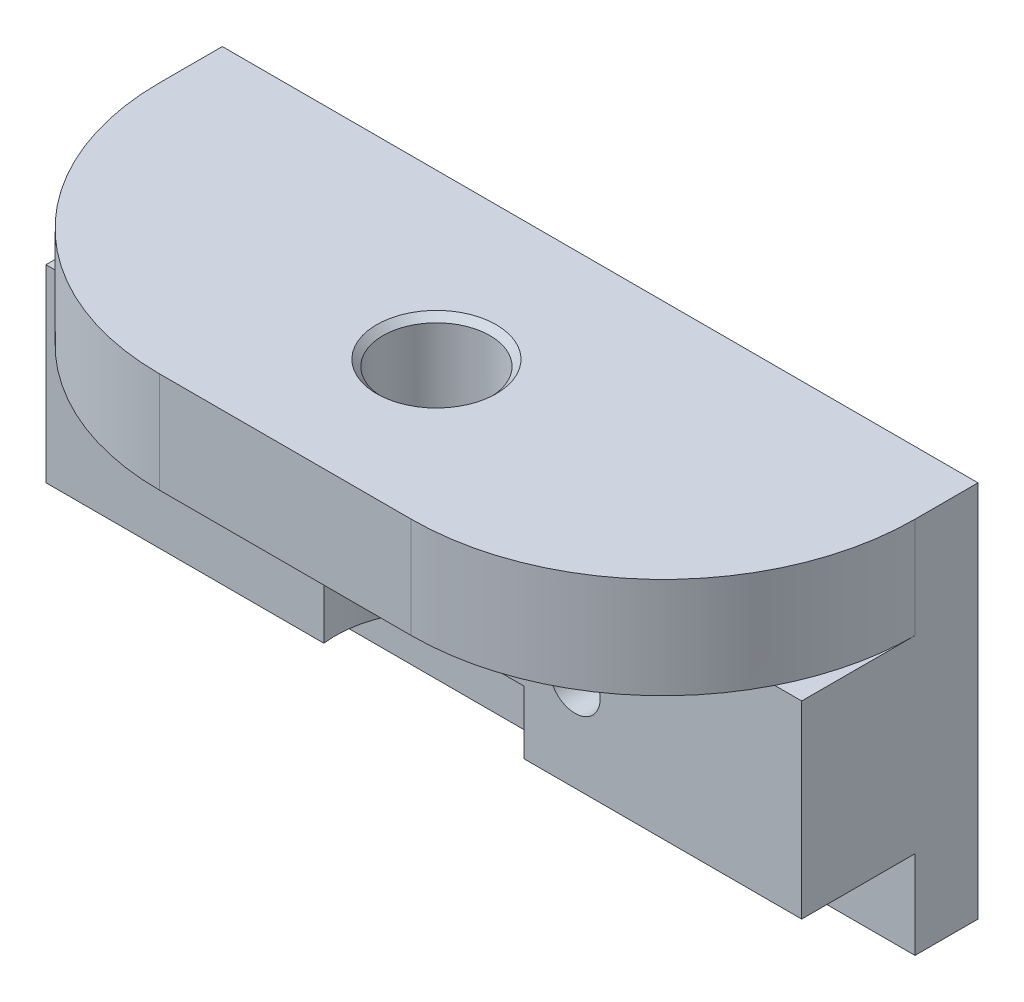
ISO-10303-21;
HEADER;
FILE_DESCRIPTION(('STEP AP214'),'2;1');
FILE_NAME('part.step','',(''),(''),'','','');
FILE_SCHEMA(('AUTOMOTIVE_DESIGN { 1 0 10303 214 1 1 1 1 }'));
ENDSEC;
DATA;
#1=APPLICATION_CONTEXT('core data for automotive mechanical design processes');
#2=APPLICATION_PROTOCOL_DEFINITION('international standard','automotive_design',2000,#1);
#3=PRODUCT_CONTEXT('',#1,'mechanical');
#4=PRODUCT('Part','Part','',(#3));
#5=PRODUCT_RELATED_PRODUCT_CATEGORY('part','',(#4));
#6=PRODUCT_DEFINITION_FORMATION('','',#4);
#7=PRODUCT_DEFINITION_CONTEXT('part definition',#1,'design');
#8=PRODUCT_DEFINITION('design','',#6,#7);
#9=PRODUCT_DEFINITION_SHAPE('','',#8);
#10=(LENGTH_UNIT() NAMED_UNIT(*) SI_UNIT(.MILLI.,.METRE.));
#11=(NAMED_UNIT(*) PLANE_ANGLE_UNIT() SI_UNIT($,.RADIAN.));
#12=(NAMED_UNIT(*) SI_UNIT($,.STERADIAN.) SOLID_ANGLE_UNIT());
#13=UNCERTAINTY_MEASURE_WITH_UNIT(LENGTH_MEASURE(1.E-05),#10,'distance_accuracy_value','');
#14=(GEOMETRIC_REPRESENTATION_CONTEXT(3) GLOBAL_UNCERTAINTY_ASSIGNED_CONTEXT((#13)) GLOBAL_UNIT_ASSIGNED_CONTEXT((#10,
#11,#12)) REPRESENTATION_CONTEXT('',''));
#15=CARTESIAN_POINT('',(0.,0.,0.));
#16=DIRECTION('',(0.,0.,1.));
#17=DIRECTION('',(1.,0.,0.));
#18=AXIS2_PLACEMENT_3D('',#15,#16,#17);
#19=CARTESIAN_POINT('',(0.,7.,13.));
#20=DIRECTION('',(0.,-1.,0.));
#21=DIRECTION('',(0.,0.,-1.));
#22=AXIS2_PLACEMENT_3D('',#19,#20,#21);
#23=CYLINDRICAL_SURFACE('',#22,8.);
#24=DIRECTION('',(0.,-1.,0.));
#25=VECTOR('',#24,1.);
#26=CARTESIAN_POINT('',(-7.93725393319378,7.,14.));
#27=LINE('',#26,#25);
#28=CARTESIAN_POINT('',(-7.93725393319378,-8.,14.));
#29=VERTEX_POINT('',#28);
#30=CARTESIAN_POINT('',(-7.93725393319378,-3.,14.));
#31=VERTEX_POINT('',#30);
#32=EDGE_CURVE('E305',#29,#31,#27,.F.);
#33=ORIENTED_EDGE('',*,*,#32,.F.);
#34=CARTESIAN_POINT('',(0.,-8.,13.));
#35=DIRECTION('',(0.,-1.,0.));
#36=DIRECTION('',(0.,0.,-1.));
#37=AXIS2_PLACEMENT_3D('',#34,#35,#36);
#38=CIRCLE('',#37,8.);
#39=CARTESIAN_POINT('',(0.,-8.,4.99999999999999));
#40=VERTEX_POINT('',#39);
#41=EDGE_CURVE('E172',#29,#40,#38,.T.);
#42=ORIENTED_EDGE('',*,*,#41,.T.);
#43=CARTESIAN_POINT('',(7.93725393319377,-8.,14.));
#44=VERTEX_POINT('',#43);
#45=EDGE_CURVE('E336',#40,#44,#38,.T.);
#46=ORIENTED_EDGE('',*,*,#45,.T.);
#47=DIRECTION('',(0.,-1.,0.));
#48=VECTOR('',#47,1.);
#49=CARTESIAN_POINT('',(7.93725393319377,7.,14.));
#50=LINE('',#49,#48);
#51=CARTESIAN_POINT('',(7.93725393319377,-3.,14.));
#52=VERTEX_POINT('',#51);
#53=EDGE_CURVE('E319',#52,#44,#50,.T.);
#54=ORIENTED_EDGE('',*,*,#53,.F.);
#55=CARTESIAN_POINT('',(0.,-3.,13.));
#56=DIRECTION('',(0.,-1.,0.));
#57=DIRECTION('',(0.,0.,-1.));
#58=AXIS2_PLACEMENT_3D('',#55,#56,#57);
#59=CIRCLE('',#58,8.);
#60=EDGE_CURVE('E250',#52,#31,#59,.F.);
#61=ORIENTED_EDGE('',*,*,#60,.T.);
#62=EDGE_LOOP('',(#33,#42,#46,#54,#61));
#63=FACE_BOUND('',#62,.T.);
#64=ADVANCED_FACE('F33',(#63),#23,.F.);
#65=CARTESIAN_POINT('',(-30.,-8.,15.));
#66=DIRECTION('',(0.,1.,0.));
#67=DIRECTION('',(-1.,0.,0.));
#68=AXIS2_PLACEMENT_3D('',#65,#66,#67);
#69=PLANE('',#68);
#70=DIRECTION('',(1.,0.,0.));
#71=VECTOR('',#70,1.);
#72=CARTESIAN_POINT('',(-30.,-8.,14.));
#73=LINE('',#72,#71);
#74=CARTESIAN_POINT('',(30.,-8.,14.));
#75=VERTEX_POINT('',#74);
#76=EDGE_CURVE('E164',#44,#75,#73,.T.);
#77=ORIENTED_EDGE('',*,*,#76,.F.);
#78=ORIENTED_EDGE('',*,*,#45,.F.);
#79=DIRECTION('',(1.,0.,0.));
#80=VECTOR('',#79,1.);
#81=CARTESIAN_POINT('',(-30.,-8.,5.));
#82=LINE('',#81,#80);
#83=CARTESIAN_POINT('',(30.,-8.,5.));
#84=VERTEX_POINT('',#83);
#85=EDGE_CURVE('E335',#40,#84,#82,.T.);
#86=ORIENTED_EDGE('',*,*,#85,.T.);
#87=DIRECTION('',(0.,0.,-1.));
#88=VECTOR('',#87,1.);
#89=CARTESIAN_POINT('',(30.,-8.,15.));
#90=LINE('',#89,#88);
#91=EDGE_CURVE('E180',#75,#84,#90,.T.);
#92=ORIENTED_EDGE('',*,*,#91,.F.);
#93=EDGE_LOOP('',(#77,#78,#86,#92));
#94=FACE_BOUND('',#93,.T.);
#95=ADVANCED_FACE('F273',(#94),#69,.F.);
#96=CARTESIAN_POINT('',(30.,15.,5.));
#97=DIRECTION('',(-1.,0.,0.));
#98=DIRECTION('',(0.,-1.,0.));
#99=AXIS2_PLACEMENT_3D('',#96,#97,#98);
#100=PLANE('',#99);
#101=DIRECTION('',(0.,1.,0.));
#102=VECTOR('',#101,1.);
#103=CARTESIAN_POINT('',(30.,7.,14.));
#104=LINE('',#103,#102);
#105=CARTESIAN_POINT('',(30.,7.,14.));
#106=VERTEX_POINT('',#105);
#107=EDGE_CURVE('E173',#75,#106,#104,.T.);
#108=ORIENTED_EDGE('',*,*,#107,.F.);
#109=ORIENTED_EDGE('',*,*,#91,.T.);
#110=DIRECTION('',(0.,1.,0.));
#111=VECTOR('',#110,1.);
#112=CARTESIAN_POINT('',(30.,15.,5.));
#113=LINE('',#112,#111);
#114=CARTESIAN_POINT('',(30.,-15.,5.));
#115=VERTEX_POINT('',#114);
#116=EDGE_CURVE('E200',#115,#84,#113,.T.);
#117=ORIENTED_EDGE('',*,*,#116,.F.);
#118=DIRECTION('',(0.,0.,-1.));
#119=VECTOR('',#118,1.);
#120=CARTESIAN_POINT('',(30.,-15.,5.));
#121=LINE('',#120,#119);
#122=CARTESIAN_POINT('',(30.,-15.,0.));
#123=VERTEX_POINT('',#122);
#124=EDGE_CURVE('E353',#115,#123,#121,.T.);
#125=ORIENTED_EDGE('',*,*,#124,.T.);
#126=DIRECTION('',(0.,1.,0.));
#127=VECTOR('',#126,1.);
#128=CARTESIAN_POINT('',(30.,15.,0.));
#129=LINE('',#128,#127);
#130=CARTESIAN_POINT('',(30.,15.,0.));
#131=VERTEX_POINT('',#130);
#132=EDGE_CURVE('E194',#123,#131,#129,.T.);
#133=ORIENTED_EDGE('',*,*,#132,.T.);
#134=DIRECTION('',(0.,0.,-1.));
#135=VECTOR('',#134,1.);
#136=CARTESIAN_POINT('',(30.,15.,5.));
#137=LINE('',#136,#135);
#138=CARTESIAN_POINT('',(30.,15.,5.));
#139=VERTEX_POINT('',#138);
#140=EDGE_CURVE('E205',#139,#131,#137,.T.);
#141=ORIENTED_EDGE('',*,*,#140,.F.);
#142=DIRECTION('',(0.,1.,0.));
#143=VECTOR('',#142,1.);
#144=CARTESIAN_POINT('',(30.,7.,5.));
#145=LINE('',#144,#143);
#146=CARTESIAN_POINT('',(30.,7.,5.));
#147=VERTEX_POINT('',#146);
#148=EDGE_CURVE('E217',#139,#147,#145,.F.);
#149=ORIENTED_EDGE('',*,*,#148,.T.);
#150=DIRECTION('',(0.,0.,-1.));
#151=VECTOR('',#150,1.);
#152=CARTESIAN_POINT('',(30.,7.,15.));
#153=LINE('',#152,#151);
#154=EDGE_CURVE('E185',#106,#147,#153,.T.);
#155=ORIENTED_EDGE('',*,*,#154,.F.);
#156=EDGE_LOOP('',(#108,#109,#117,#125,#133,#141,#149,#155));
#157=FACE_BOUND('',#156,.T.);
#158=ADVANCED_FACE('F280',(#157),#100,.F.);
#159=CARTESIAN_POINT('',(-30.,15.,5.));
#160=DIRECTION('',(1.,0.,0.));
#161=DIRECTION('',(0.,1.,0.));
#162=AXIS2_PLACEMENT_3D('',#159,#160,#161);
#163=PLANE('',#162);
#164=DIRECTION('',(0.,-1.,0.));
#165=VECTOR('',#164,1.);
#166=CARTESIAN_POINT('',(-30.,7.,14.));
#167=LINE('',#166,#165);
#168=CARTESIAN_POINT('',(-30.,7.,14.));
#169=VERTEX_POINT('',#168);
#170=CARTESIAN_POINT('',(-30.,-8.,14.));
#171=VERTEX_POINT('',#170);
#172=EDGE_CURVE('E153',#169,#171,#167,.T.);
#173=ORIENTED_EDGE('',*,*,#172,.F.);
#174=DIRECTION('',(0.,0.,-1.));
#175=VECTOR('',#174,1.);
#176=CARTESIAN_POINT('',(-30.,7.,15.));
#177=LINE('',#176,#175);
#178=CARTESIAN_POINT('',(-30.,7.,5.));
#179=VERTEX_POINT('',#178);
#180=EDGE_CURVE('E237',#169,#179,#177,.T.);
#181=ORIENTED_EDGE('',*,*,#180,.T.);
#182=DIRECTION('',(0.,-1.,0.));
#183=VECTOR('',#182,1.);
#184=CARTESIAN_POINT('',(-30.,15.,5.));
#185=LINE('',#184,#183);
#186=CARTESIAN_POINT('',(-30.,15.,5.));
#187=VERTEX_POINT('',#186);
#188=EDGE_CURVE('E251',#179,#187,#185,.F.);
#189=ORIENTED_EDGE('',*,*,#188,.T.);
#190=DIRECTION('',(0.,0.,-1.));
#191=VECTOR('',#190,1.);
#192=CARTESIAN_POINT('',(-30.,15.,5.));
#193=LINE('',#192,#191);
#194=CARTESIAN_POINT('',(-30.,15.,0.));
#195=VERTEX_POINT('',#194);
#196=EDGE_CURVE('E598',#187,#195,#193,.T.);
#197=ORIENTED_EDGE('',*,*,#196,.T.);
#198=DIRECTION('',(0.,-1.,0.));
#199=VECTOR('',#198,1.);
#200=CARTESIAN_POINT('',(-30.,15.,0.));
#201=LINE('',#200,#199);
#202=CARTESIAN_POINT('',(-30.,-15.,0.));
#203=VERTEX_POINT('',#202);
#204=EDGE_CURVE('E605',#195,#203,#201,.T.);
#205=ORIENTED_EDGE('',*,*,#204,.T.);
#206=DIRECTION('',(0.,0.,-1.));
#207=VECTOR('',#206,1.);
#208=CARTESIAN_POINT('',(-30.,-15.,5.));
#209=LINE('',#208,#207);
#210=CARTESIAN_POINT('',(-30.,-15.,5.));
#211=VERTEX_POINT('',#210);
#212=EDGE_CURVE('E599',#211,#203,#209,.T.);
#213=ORIENTED_EDGE('',*,*,#212,.F.);
#214=DIRECTION('',(0.,-1.,0.));
#215=VECTOR('',#214,1.);
#216=CARTESIAN_POINT('',(-30.,15.,5.));
#217=LINE('',#216,#215);
#218=CARTESIAN_POINT('',(-30.,-8.,5.));
#219=VERTEX_POINT('',#218);
#220=EDGE_CURVE('E178',#219,#211,#217,.T.);
#221=ORIENTED_EDGE('',*,*,#220,.F.);
#222=DIRECTION('',(0.,0.,-1.));
#223=VECTOR('',#222,1.);
#224=CARTESIAN_POINT('',(-30.,-8.,15.));
#225=LINE('',#224,#223);
#226=EDGE_CURVE('E170',#171,#219,#225,.T.);
#227=ORIENTED_EDGE('',*,*,#226,.F.);
#228=EDGE_LOOP('',(#173,#181,#189,#197,#205,#213,#221,#227));
#229=FACE_BOUND('',#228,.T.);
#230=ADVANCED_FACE('F176',(#229),#163,.F.);
#231=CARTESIAN_POINT('',(-30.,7.,15.));
#232=DIRECTION('',(0.,-1.,0.));
#233=DIRECTION('',(0.,0.,-1.));
#234=AXIS2_PLACEMENT_3D('',#231,#232,#233);
#235=PLANE('',#234);
#236=DIRECTION('',(-1.,0.,0.));
#237=VECTOR('',#236,1.);
#238=CARTESIAN_POINT('',(-30.,7.,14.));
#239=LINE('',#238,#237);
#240=CARTESIAN_POINT('',(27.8605710994918,7.,14.));
#241=VERTEX_POINT('',#240);
#242=EDGE_CURVE('E361',#106,#241,#239,.T.);
#243=ORIENTED_EDGE('',*,*,#242,.F.);
#244=ORIENTED_EDGE('',*,*,#154,.T.);
#245=CARTESIAN_POINT('',(9.99999999999999,7.,5.));
#246=DIRECTION('',(0.,1.,0.));
#247=DIRECTION('',(0.,0.,1.));
#248=AXIS2_PLACEMENT_3D('',#245,#246,#247);
#249=CIRCLE('',#248,20.);
#250=EDGE_CURVE('E228',#147,#241,#249,.F.);
#251=ORIENTED_EDGE('',*,*,#250,.T.);
#252=EDGE_LOOP('',(#243,#244,#251));
#253=FACE_BOUND('',#252,.T.);
#254=ADVANCED_FACE('F296',(#253),#235,.F.);
#255=EDGE_CURVE('E156',#171,#29,#73,.T.);
#256=ORIENTED_EDGE('',*,*,#255,.F.);
#257=ORIENTED_EDGE('',*,*,#226,.T.);
#258=EDGE_CURVE('E240',#219,#40,#82,.T.);
#259=ORIENTED_EDGE('',*,*,#258,.T.);
#260=ORIENTED_EDGE('',*,*,#41,.F.);
#261=EDGE_LOOP('',(#256,#257,#259,#260));
#262=FACE_BOUND('',#261,.T.);
#263=ADVANCED_FACE('F168',(#262),#69,.F.);
#264=CARTESIAN_POINT('',(-27.8605710994918,7.,14.));
#265=VERTEX_POINT('',#264);
#266=EDGE_CURVE('E160',#265,#169,#239,.T.);
#267=ORIENTED_EDGE('',*,*,#266,.F.);
#268=CARTESIAN_POINT('',(-10.,7.,5.));
#269=DIRECTION('',(0.,1.,0.));
#270=DIRECTION('',(0.,0.,1.));
#271=AXIS2_PLACEMENT_3D('',#268,#269,#270);
#272=CIRCLE('',#271,20.);
#273=EDGE_CURVE('E220',#265,#179,#272,.F.);
#274=ORIENTED_EDGE('',*,*,#273,.T.);
#275=ORIENTED_EDGE('',*,*,#180,.F.);
#276=EDGE_LOOP('',(#267,#274,#275));
#277=FACE_BOUND('',#276,.T.);
#278=ADVANCED_FACE('F287',(#277),#235,.F.);
#279=DIRECTION('',(0.,-1.,0.));
#280=VECTOR('',#279,1.);
#281=CARTESIAN_POINT('',(-7.93725393319378,7.,14.));
#282=LINE('',#281,#280);
#283=CARTESIAN_POINT('',(-7.93725393319378,1.5,14.));
#284=VERTEX_POINT('',#283);
#285=CARTESIAN_POINT('',(-7.93725393319378,7.,14.));
#286=VERTEX_POINT('',#285);
#287=EDGE_CURVE('E299',#284,#286,#282,.F.);
#288=ORIENTED_EDGE('',*,*,#287,.F.);
#289=CARTESIAN_POINT('',(0.,1.5,13.));
#290=DIRECTION('',(0.,1.,0.));
#291=DIRECTION('',(0.,0.,1.));
#292=AXIS2_PLACEMENT_3D('',#289,#290,#291);
#293=CIRCLE('',#292,8.);
#294=CARTESIAN_POINT('',(7.93725393319377,1.5,14.));
#295=VERTEX_POINT('',#294);
#296=EDGE_CURVE('E247',#284,#295,#293,.F.);
#297=ORIENTED_EDGE('',*,*,#296,.T.);
#298=DIRECTION('',(0.,-1.,0.));
#299=VECTOR('',#298,1.);
#300=CARTESIAN_POINT('',(7.93725393319377,7.,14.));
#301=LINE('',#300,#299);
#302=CARTESIAN_POINT('',(7.93725393319377,7.,14.));
#303=VERTEX_POINT('',#302);
#304=EDGE_CURVE('E314',#303,#295,#301,.T.);
#305=ORIENTED_EDGE('',*,*,#304,.F.);
#306=CARTESIAN_POINT('',(0.,7.,13.));
#307=DIRECTION('',(0.,-1.,0.));
#308=DIRECTION('',(0.,0.,-1.));
#309=AXIS2_PLACEMENT_3D('',#306,#307,#308);
#310=CIRCLE('',#309,8.);
#311=EDGE_CURVE('E303',#286,#303,#310,.T.);
#312=ORIENTED_EDGE('',*,*,#311,.F.);
#313=EDGE_LOOP('',(#288,#297,#305,#312));
#314=FACE_BOUND('',#313,.T.);
#315=ADVANCED_FACE('F276',(#314),#23,.F.);
#316=CARTESIAN_POINT('',(-30.,-3.,-55.1685133603947));
#317=DIRECTION('',(0.,-1.,0.));
#318=DIRECTION('',(0.,0.,-1.));
#319=AXIS2_PLACEMENT_3D('',#316,#317,#318);
#320=PLANE('',#319);
#321=ORIENTED_EDGE('',*,*,#60,.F.);
#322=DIRECTION('',(-1.,0.,0.));
#323=VECTOR('',#322,1.);
#324=CARTESIAN_POINT('',(-30.,-3.,14.));
#325=LINE('',#324,#323);
#326=CARTESIAN_POINT('',(6.2201286160336,-3.,14.));
#327=VERTEX_POINT('',#326);
#328=EDGE_CURVE('E310',#52,#327,#325,.T.);
#329=ORIENTED_EDGE('',*,*,#328,.T.);
#330=CARTESIAN_POINT('',(0.,-3.,13.));
#331=DIRECTION('',(0.,-1.,0.));
#332=DIRECTION('',(0.,0.,-1.));
#333=AXIS2_PLACEMENT_3D('',#330,#331,#332);
#334=CIRCLE('',#333,6.3);
#335=CARTESIAN_POINT('',(-6.2201286160336,-3.,14.));
#336=VERTEX_POINT('',#335);
#337=EDGE_CURVE('E331',#336,#327,#334,.T.);
#338=ORIENTED_EDGE('',*,*,#337,.F.);
#339=EDGE_CURVE('E48',#336,#31,#325,.T.);
#340=ORIENTED_EDGE('',*,*,#339,.T.);
#341=EDGE_LOOP('',(#321,#329,#338,#340));
#342=FACE_BOUND('',#341,.T.);
#343=ADVANCED_FACE('F286',(#342),#320,.T.);
#344=CARTESIAN_POINT('',(-30.,1.5,-55.1685133603947));
#345=DIRECTION('',(0.,1.,0.));
#346=DIRECTION('',(0.,0.,1.));
#347=AXIS2_PLACEMENT_3D('',#344,#345,#346);
#348=PLANE('',#347);
#349=ORIENTED_EDGE('',*,*,#296,.F.);
#350=DIRECTION('',(1.,0.,0.));
#351=VECTOR('',#350,1.);
#352=CARTESIAN_POINT('',(-30.,1.5,14.));
#353=LINE('',#352,#351);
#354=CARTESIAN_POINT('',(-6.2201286160336,1.5,14.));
#355=VERTEX_POINT('',#354);
#356=EDGE_CURVE('E309',#284,#355,#353,.T.);
#357=ORIENTED_EDGE('',*,*,#356,.T.);
#358=CARTESIAN_POINT('',(0.,1.5,13.));
#359=DIRECTION('',(0.,1.,0.));
#360=DIRECTION('',(0.,0.,1.));
#361=AXIS2_PLACEMENT_3D('',#358,#359,#360);
#362=CIRCLE('',#361,6.3);
#363=CARTESIAN_POINT('',(6.2201286160336,1.5,14.));
#364=VERTEX_POINT('',#363);
#365=EDGE_CURVE('E253',#364,#355,#362,.T.);
#366=ORIENTED_EDGE('',*,*,#365,.F.);
#367=EDGE_CURVE('E56',#364,#295,#353,.T.);
#368=ORIENTED_EDGE('',*,*,#367,.T.);
#369=EDGE_LOOP('',(#349,#357,#366,#368));
#370=FACE_BOUND('',#369,.T.);
#371=ADVANCED_FACE('F293',(#370),#348,.T.);
#372=CARTESIAN_POINT('',(0.,1.5,13.));
#373=DIRECTION('',(0.,-1.,0.));
#374=DIRECTION('',(0.,0.,-1.));
#375=AXIS2_PLACEMENT_3D('',#372,#373,#374);
#376=CYLINDRICAL_SURFACE('',#375,6.3);
#377=DIRECTION('',(0.,-1.,0.));
#378=VECTOR('',#377,1.);
#379=CARTESIAN_POINT('',(-6.2201286160336,1.5,14.));
#380=LINE('',#379,#378);
#381=EDGE_CURVE('E318',#336,#355,#380,.F.);
#382=ORIENTED_EDGE('',*,*,#381,.F.);
#383=ORIENTED_EDGE('',*,*,#337,.T.);
#384=DIRECTION('',(0.,-1.,0.));
#385=VECTOR('',#384,1.);
#386=CARTESIAN_POINT('',(6.2201286160336,1.5,14.));
#387=LINE('',#386,#385);
#388=EDGE_CURVE('E311',#364,#327,#387,.T.);
#389=ORIENTED_EDGE('',*,*,#388,.F.);
#390=ORIENTED_EDGE('',*,*,#365,.T.);
#391=EDGE_LOOP('',(#382,#383,#389,#390));
#392=FACE_BOUND('',#391,.T.);
#393=ADVANCED_FACE('F381',(#392),#376,.F.);
#394=CARTESIAN_POINT('',(12.,-0.850000000000004,0.));
#395=DIRECTION('',(0.,0.,1.));
#396=DIRECTION('',(1.,0.,0.));
#397=AXIS2_PLACEMENT_3D('',#394,#395,#396);
#398=CYLINDRICAL_SURFACE('',#397,2.);
#399=CARTESIAN_POINT('',(12.,-0.850000000000004,0.));
#400=DIRECTION('',(0.,0.,1.));
#401=DIRECTION('',(1.,0.,0.));
#402=AXIS2_PLACEMENT_3D('',#399,#400,#401);
#403=CIRCLE('',#402,2.);
#404=CARTESIAN_POINT('',(14.,-0.850000000000004,0.));
#405=VERTEX_POINT('',#404);
#406=EDGE_CURVE('E328',#405,#405,#403,.T.);
#407=ORIENTED_EDGE('',*,*,#406,.F.);
#408=EDGE_LOOP('',(#407));
#409=FACE_BOUND('',#408,.T.);
#410=CARTESIAN_POINT('',(12.,-0.850000000000004,14.));
#411=DIRECTION('',(0.,0.,1.));
#412=DIRECTION('',(1.,0.,0.));
#413=AXIS2_PLACEMENT_3D('',#410,#411,#412);
#414=CIRCLE('',#413,2.);
#415=CARTESIAN_POINT('',(14.,-0.850000000000004,14.));
#416=VERTEX_POINT('',#415);
#417=EDGE_CURVE('E316',#416,#416,#414,.F.);
#418=ORIENTED_EDGE('',*,*,#417,.F.);
#419=EDGE_LOOP('',(#418));
#420=FACE_BOUND('',#419,.T.);
#421=ADVANCED_FACE('F372',(#409,#420),#398,.F.);
#422=CARTESIAN_POINT('',(-12.,-0.850000000000001,0.));
#423=DIRECTION('',(0.,0.,1.));
#424=DIRECTION('',(1.,0.,0.));
#425=AXIS2_PLACEMENT_3D('',#422,#423,#424);
#426=CYLINDRICAL_SURFACE('',#425,2.);
#427=CARTESIAN_POINT('',(-12.,-0.850000000000001,0.));
#428=DIRECTION('',(0.,0.,1.));
#429=DIRECTION('',(1.,0.,0.));
#430=AXIS2_PLACEMENT_3D('',#427,#428,#429);
#431=CIRCLE('',#430,2.);
#432=CARTESIAN_POINT('',(-10.,-0.850000000000001,0.));
#433=VERTEX_POINT('',#432);
#434=EDGE_CURVE('E325',#433,#433,#431,.T.);
#435=ORIENTED_EDGE('',*,*,#434,.F.);
#436=EDGE_LOOP('',(#435));
#437=FACE_BOUND('',#436,.T.);
#438=CARTESIAN_POINT('',(-12.,-0.850000000000001,14.));
#439=DIRECTION('',(0.,0.,1.));
#440=DIRECTION('',(1.,0.,0.));
#441=AXIS2_PLACEMENT_3D('',#438,#439,#440);
#442=CIRCLE('',#441,2.);
#443=CARTESIAN_POINT('',(-10.,-0.850000000000001,14.));
#444=VERTEX_POINT('',#443);
#445=EDGE_CURVE('E235',#444,#444,#442,.F.);
#446=ORIENTED_EDGE('',*,*,#445,.F.);
#447=EDGE_LOOP('',(#446));
#448=FACE_BOUND('',#447,.T.);
#449=ADVANCED_FACE('F370',(#437,#448),#426,.F.);
#450=CARTESIAN_POINT('',(0.,0.,5.));
#451=DIRECTION('',(0.,0.,1.));
#452=DIRECTION('',(1.,0.,0.));
#453=AXIS2_PLACEMENT_3D('',#450,#451,#452);
#454=PLANE('',#453);
#455=ORIENTED_EDGE('',*,*,#116,.T.);
#456=ORIENTED_EDGE('',*,*,#85,.F.);
#457=ORIENTED_EDGE('',*,*,#258,.F.);
#458=ORIENTED_EDGE('',*,*,#220,.T.);
#459=DIRECTION('',(1.,0.,0.));
#460=VECTOR('',#459,1.);
#461=CARTESIAN_POINT('',(-30.,-15.,5.));
#462=LINE('',#461,#460);
#463=EDGE_CURVE('E347',#211,#115,#462,.T.);
#464=ORIENTED_EDGE('',*,*,#463,.T.);
#465=EDGE_LOOP('',(#455,#456,#457,#458,#464));
#466=FACE_BOUND('',#465,.T.);
#467=ADVANCED_FACE('F345',(#466),#454,.T.);
#468=CARTESIAN_POINT('',(-30.,7.,25.));
#469=DIRECTION('',(0.,1.,0.));
#470=DIRECTION('',(0.,0.,1.));
#471=AXIS2_PLACEMENT_3D('',#468,#469,#470);
#472=PLANE('',#471);
#473=CARTESIAN_POINT('',(0.,7.,13.));
#474=DIRECTION('',(0.,1.,0.));
#475=DIRECTION('',(0.,0.,1.));
#476=AXIS2_PLACEMENT_3D('',#473,#474,#475);
#477=CIRCLE('',#476,4.25);
#478=CARTESIAN_POINT('',(0.,7.,17.25));
#479=VERTEX_POINT('',#478);
#480=EDGE_CURVE('E179',#479,#479,#477,.F.);
#481=ORIENTED_EDGE('',*,*,#480,.F.);
#482=EDGE_LOOP('',(#481));
#483=FACE_BOUND('',#482,.T.);
#484=EDGE_CURVE('E359',#286,#265,#239,.T.);
#485=ORIENTED_EDGE('',*,*,#484,.F.);
#486=ORIENTED_EDGE('',*,*,#311,.T.);
#487=EDGE_CURVE('E363',#241,#303,#239,.T.);
#488=ORIENTED_EDGE('',*,*,#487,.F.);
#489=CARTESIAN_POINT('',(9.99999999999999,7.,25.));
#490=VERTEX_POINT('',#489);
#491=EDGE_CURVE('E225',#241,#490,#249,.F.);
#492=ORIENTED_EDGE('',*,*,#491,.T.);
#493=DIRECTION('',(1.,0.,0.));
#494=VECTOR('',#493,1.);
#495=CARTESIAN_POINT('',(-30.,7.,25.));
#496=LINE('',#495,#494);
#497=CARTESIAN_POINT('',(-10.,7.,25.));
#498=VERTEX_POINT('',#497);
#499=EDGE_CURVE('E183',#498,#490,#496,.T.);
#500=ORIENTED_EDGE('',*,*,#499,.F.);
#501=EDGE_CURVE('E223',#498,#265,#272,.F.);
#502=ORIENTED_EDGE('',*,*,#501,.T.);
#503=EDGE_LOOP('',(#485,#486,#488,#492,#500,#502));
#504=FACE_BOUND('',#503,.T.);
#505=ADVANCED_FACE('F379',(#483,#504),#472,.F.);
#506=CARTESIAN_POINT('',(-30.,15.,5.));
#507=DIRECTION('',(0.,-1.,0.));
#508=DIRECTION('',(0.,0.,-1.));
#509=AXIS2_PLACEMENT_3D('',#506,#507,#508);
#510=PLANE('',#509);
#511=CARTESIAN_POINT('',(0.,15.,13.));
#512=DIRECTION('',(0.,-1.,0.));
#513=DIRECTION('',(0.,0.,-1.));
#514=AXIS2_PLACEMENT_3D('',#511,#512,#513);
#515=CIRCLE('',#514,4.75);
#516=CARTESIAN_POINT('',(0.,15.,8.24999999999999));
#517=VERTEX_POINT('',#516);
#518=EDGE_CURVE('E11',#517,#517,#515,.T.);
#519=ORIENTED_EDGE('',*,*,#518,.T.);
#520=EDGE_LOOP('',(#519));
#521=FACE_BOUND('',#520,.T.);
#522=DIRECTION('',(-1.,0.,0.));
#523=VECTOR('',#522,1.);
#524=CARTESIAN_POINT('',(-30.,15.,25.));
#525=LINE('',#524,#523);
#526=CARTESIAN_POINT('',(9.99999999999999,15.,25.));
#527=VERTEX_POINT('',#526);
#528=CARTESIAN_POINT('',(-10.,15.,25.));
#529=VERTEX_POINT('',#528);
#530=EDGE_CURVE('E191',#527,#529,#525,.T.);
#531=ORIENTED_EDGE('',*,*,#530,.F.);
#532=CARTESIAN_POINT('',(9.99999999999999,15.,5.));
#533=DIRECTION('',(0.,-1.,0.));
#534=DIRECTION('',(0.,0.,-1.));
#535=AXIS2_PLACEMENT_3D('',#532,#533,#534);
#536=CIRCLE('',#535,20.);
#537=EDGE_CURVE('E215',#527,#139,#536,.F.);
#538=ORIENTED_EDGE('',*,*,#537,.T.);
#539=ORIENTED_EDGE('',*,*,#140,.T.);
#540=DIRECTION('',(-1.,0.,0.));
#541=VECTOR('',#540,1.);
#542=CARTESIAN_POINT('',(-30.,15.,0.));
#543=LINE('',#542,#541);
#544=EDGE_CURVE('E607',#131,#195,#543,.T.);
#545=ORIENTED_EDGE('',*,*,#544,.T.);
#546=ORIENTED_EDGE('',*,*,#196,.F.);
#547=CARTESIAN_POINT('',(-10.,15.,5.));
#548=DIRECTION('',(0.,-1.,0.));
#549=DIRECTION('',(0.,0.,-1.));
#550=AXIS2_PLACEMENT_3D('',#547,#548,#549);
#551=CIRCLE('',#550,20.);
#552=EDGE_CURVE('E213',#187,#529,#551,.F.);
#553=ORIENTED_EDGE('',*,*,#552,.T.);
#554=EDGE_LOOP('',(#531,#538,#539,#545,#546,#553));
#555=FACE_BOUND('',#554,.T.);
#556=ADVANCED_FACE('F415',(#521,#555),#510,.F.);
#557=CARTESIAN_POINT('',(-30.,-15.,5.));
#558=DIRECTION('',(0.,1.,0.));
#559=DIRECTION('',(0.,0.,1.));
#560=AXIS2_PLACEMENT_3D('',#557,#558,#559);
#561=PLANE('',#560);
#562=DIRECTION('',(1.,0.,0.));
#563=VECTOR('',#562,1.);
#564=CARTESIAN_POINT('',(-30.,-15.,0.));
#565=LINE('',#564,#563);
#566=EDGE_CURVE('E204',#203,#123,#565,.T.);
#567=ORIENTED_EDGE('',*,*,#566,.T.);
#568=ORIENTED_EDGE('',*,*,#124,.F.);
#569=ORIENTED_EDGE('',*,*,#463,.F.);
#570=ORIENTED_EDGE('',*,*,#212,.T.);
#571=EDGE_LOOP('',(#567,#568,#569,#570));
#572=FACE_BOUND('',#571,.T.);
#573=ADVANCED_FACE('F462',(#572),#561,.F.);
#574=CARTESIAN_POINT('',(0.,0.,0.));
#575=DIRECTION('',(0.,0.,1.));
#576=DIRECTION('',(1.,0.,0.));
#577=AXIS2_PLACEMENT_3D('',#574,#575,#576);
#578=PLANE('',#577);
#579=ORIENTED_EDGE('',*,*,#434,.T.);
#580=EDGE_LOOP('',(#579));
#581=FACE_BOUND('',#580,.T.);
#582=ORIENTED_EDGE('',*,*,#406,.T.);
#583=EDGE_LOOP('',(#582));
#584=FACE_BOUND('',#583,.T.);
#585=ORIENTED_EDGE('',*,*,#132,.F.);
#586=ORIENTED_EDGE('',*,*,#566,.F.);
#587=ORIENTED_EDGE('',*,*,#204,.F.);
#588=ORIENTED_EDGE('',*,*,#544,.F.);
#589=EDGE_LOOP('',(#585,#586,#587,#588));
#590=FACE_BOUND('',#589,.T.);
#591=ADVANCED_FACE('F485',(#581,#584,#590),#578,.F.);
#592=CARTESIAN_POINT('',(0.,0.,25.));
#593=DIRECTION('',(0.,0.,1.));
#594=DIRECTION('',(1.,0.,0.));
#595=AXIS2_PLACEMENT_3D('',#592,#593,#594);
#596=PLANE('',#595);
#597=ORIENTED_EDGE('',*,*,#499,.T.);
#598=DIRECTION('',(0.,1.,0.));
#599=VECTOR('',#598,1.);
#600=CARTESIAN_POINT('',(9.99999999999999,15.,25.));
#601=LINE('',#600,#599);
#602=EDGE_CURVE('E210',#490,#527,#601,.T.);
#603=ORIENTED_EDGE('',*,*,#602,.T.);
#604=ORIENTED_EDGE('',*,*,#530,.T.);
#605=DIRECTION('',(0.,-1.,0.));
#606=VECTOR('',#605,1.);
#607=CARTESIAN_POINT('',(-10.,7.,25.));
#608=LINE('',#607,#606);
#609=EDGE_CURVE('E207',#529,#498,#608,.T.);
#610=ORIENTED_EDGE('',*,*,#609,.T.);
#611=EDGE_LOOP('',(#597,#603,#604,#610));
#612=FACE_BOUND('',#611,.T.);
#613=ADVANCED_FACE('F473',(#612),#596,.T.);
#614=CARTESIAN_POINT('',(0.,-5.02081528017131,13.));
#615=DIRECTION('',(0.,1.,0.));
#616=DIRECTION('',(0.,0.,1.));
#617=AXIS2_PLACEMENT_3D('',#614,#615,#616);
#618=CYLINDRICAL_SURFACE('',#617,4.25);
#619=CARTESIAN_POINT('',(0.,14.5,13.));
#620=DIRECTION('',(0.,-1.,0.));
#621=DIRECTION('',(0.,0.,-1.));
#622=AXIS2_PLACEMENT_3D('',#619,#620,#621);
#623=CIRCLE('',#622,4.25);
#624=CARTESIAN_POINT('',(0.,14.5,8.74999999999999));
#625=VERTEX_POINT('',#624);
#626=EDGE_CURVE('E41',#625,#625,#623,.F.);
#627=ORIENTED_EDGE('',*,*,#626,.T.);
#628=EDGE_LOOP('',(#627));
#629=FACE_BOUND('',#628,.T.);
#630=ORIENTED_EDGE('',*,*,#480,.T.);
#631=EDGE_LOOP('',(#630));
#632=FACE_BOUND('',#631,.T.);
#633=ADVANCED_FACE('F260',(#629,#632),#618,.F.);
#634=CARTESIAN_POINT('',(9.99999999999999,0.,5.));
#635=DIRECTION('',(0.,-1.,0.));
#636=DIRECTION('',(1.,0.,0.));
#637=AXIS2_PLACEMENT_3D('',#634,#635,#636);
#638=CYLINDRICAL_SURFACE('',#637,20.);
#639=ORIENTED_EDGE('',*,*,#250,.F.);
#640=ORIENTED_EDGE('',*,*,#148,.F.);
#641=ORIENTED_EDGE('',*,*,#537,.F.);
#642=ORIENTED_EDGE('',*,*,#602,.F.);
#643=ORIENTED_EDGE('',*,*,#491,.F.);
#644=EDGE_LOOP('',(#639,#640,#641,#642,#643));
#645=FACE_BOUND('',#644,.T.);
#646=ADVANCED_FACE('F424',(#645),#638,.T.);
#647=CARTESIAN_POINT('',(-10.,0.,5.));
#648=DIRECTION('',(0.,1.,0.));
#649=DIRECTION('',(-1.,0.,0.));
#650=AXIS2_PLACEMENT_3D('',#647,#648,#649);
#651=CYLINDRICAL_SURFACE('',#650,20.);
#652=ORIENTED_EDGE('',*,*,#552,.F.);
#653=ORIENTED_EDGE('',*,*,#188,.F.);
#654=ORIENTED_EDGE('',*,*,#273,.F.);
#655=ORIENTED_EDGE('',*,*,#501,.F.);
#656=ORIENTED_EDGE('',*,*,#609,.F.);
#657=EDGE_LOOP('',(#652,#653,#654,#655,#656));
#658=FACE_BOUND('',#657,.T.);
#659=ADVANCED_FACE('F429',(#658),#651,.T.);
#660=CARTESIAN_POINT('',(0.,0.,14.));
#661=DIRECTION('',(0.,0.,1.));
#662=DIRECTION('',(1.,0.,0.));
#663=AXIS2_PLACEMENT_3D('',#660,#661,#662);
#664=PLANE('',#663);
#665=ORIENTED_EDGE('',*,*,#445,.T.);
#666=EDGE_LOOP('',(#665));
#667=FACE_BOUND('',#666,.T.);
#668=ORIENTED_EDGE('',*,*,#32,.T.);
#669=ORIENTED_EDGE('',*,*,#339,.F.);
#670=ORIENTED_EDGE('',*,*,#381,.T.);
#671=ORIENTED_EDGE('',*,*,#356,.F.);
#672=ORIENTED_EDGE('',*,*,#287,.T.);
#673=ORIENTED_EDGE('',*,*,#484,.T.);
#674=ORIENTED_EDGE('',*,*,#266,.T.);
#675=ORIENTED_EDGE('',*,*,#172,.T.);
#676=ORIENTED_EDGE('',*,*,#255,.T.);
#677=EDGE_LOOP('',(#668,#669,#670,#671,#672,#673,#674,#675,#676));
#678=FACE_BOUND('',#677,.T.);
#679=ADVANCED_FACE('F155',(#667,#678),#664,.T.);
#680=ORIENTED_EDGE('',*,*,#417,.T.);
#681=EDGE_LOOP('',(#680));
#682=FACE_BOUND('',#681,.T.);
#683=ORIENTED_EDGE('',*,*,#53,.T.);
#684=ORIENTED_EDGE('',*,*,#76,.T.);
#685=ORIENTED_EDGE('',*,*,#107,.T.);
#686=ORIENTED_EDGE('',*,*,#242,.T.);
#687=ORIENTED_EDGE('',*,*,#487,.T.);
#688=ORIENTED_EDGE('',*,*,#304,.T.);
#689=ORIENTED_EDGE('',*,*,#367,.F.);
#690=ORIENTED_EDGE('',*,*,#388,.T.);
#691=ORIENTED_EDGE('',*,*,#328,.F.);
#692=EDGE_LOOP('',(#683,#684,#685,#686,#687,#688,#689,#690,#691));
#693=FACE_BOUND('',#692,.T.);
#694=ADVANCED_FACE('F264',(#682,#693),#664,.T.);
#695=CARTESIAN_POINT('',(0.,14.5,13.));
#696=DIRECTION('',(0.,1.,0.));
#697=DIRECTION('',(0.,0.,1.));
#698=AXIS2_PLACEMENT_3D('',#695,#696,#697);
#699=CONICAL_SURFACE('',#698,4.25,0.785398163397441);
#700=ORIENTED_EDGE('',*,*,#518,.F.);
#701=EDGE_LOOP('',(#700));
#702=FACE_BOUND('',#701,.T.);
#703=ORIENTED_EDGE('',*,*,#626,.F.);
#704=EDGE_LOOP('',(#703));
#705=FACE_BOUND('',#704,.T.);
#706=ADVANCED_FACE('F35',(#702,#705),#699,.F.);
#707=CLOSED_SHELL('',(#64,#95,#158,#230,#254,#263,#278,#315,#343,#371,#393,#421,#449,#467,#505,
#556,#573,#591,#613,#633,#646,#659,#679,#694,#706));
#708=MANIFOLD_SOLID_BREP('B2',#707);
#709=ADVANCED_BREP_SHAPE_REPRESENTATION('',(#18,#708),#14);
#710=SHAPE_DEFINITION_REPRESENTATION(#9,#709);
ENDSEC;
END-ISO-10303-21;
